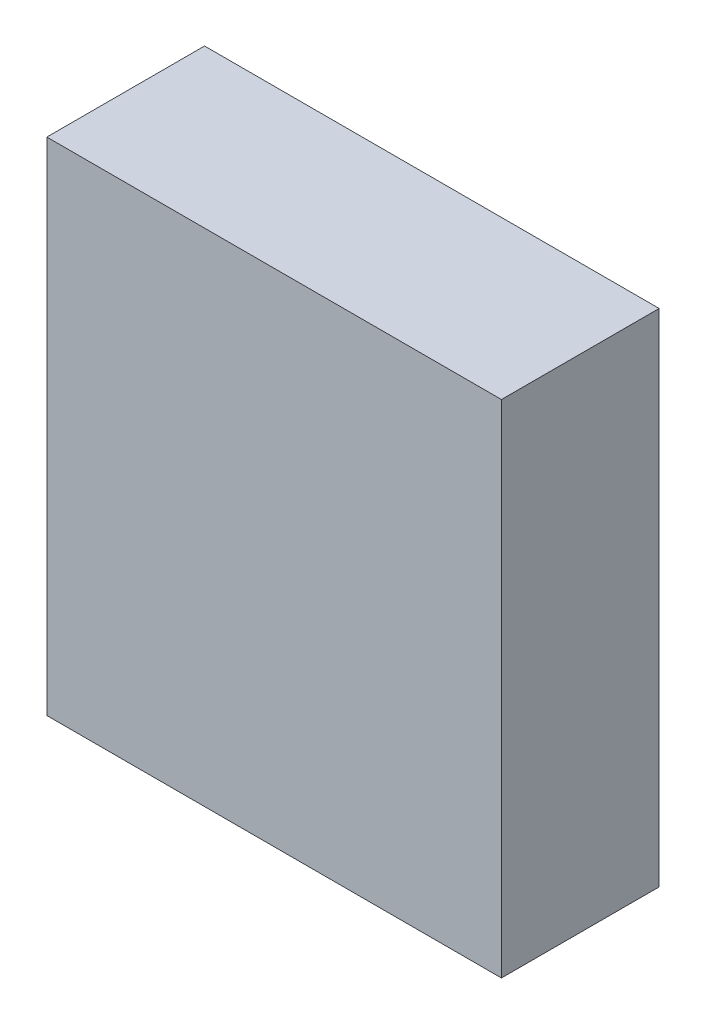
ISO-10303-21;
HEADER;
FILE_DESCRIPTION(('STEP AP214'),'2;1');
FILE_NAME('part.step','',(''),(''),'','','');
FILE_SCHEMA(('AUTOMOTIVE_DESIGN { 1 0 10303 214 1 1 1 1 }'));
ENDSEC;
DATA;
#1=APPLICATION_CONTEXT('core data for automotive mechanical design processes');
#2=APPLICATION_PROTOCOL_DEFINITION('international standard','automotive_design',2000,#1);
#3=PRODUCT_CONTEXT('',#1,'mechanical');
#4=PRODUCT('Part','Part','',(#3));
#5=PRODUCT_RELATED_PRODUCT_CATEGORY('part','',(#4));
#6=PRODUCT_DEFINITION_FORMATION('','',#4);
#7=PRODUCT_DEFINITION_CONTEXT('part definition',#1,'design');
#8=PRODUCT_DEFINITION('design','',#6,#7);
#9=PRODUCT_DEFINITION_SHAPE('','',#8);
#10=(LENGTH_UNIT() NAMED_UNIT(*) SI_UNIT(.MILLI.,.METRE.));
#11=(NAMED_UNIT(*) PLANE_ANGLE_UNIT() SI_UNIT($,.RADIAN.));
#12=(NAMED_UNIT(*) SI_UNIT($,.STERADIAN.) SOLID_ANGLE_UNIT());
#13=UNCERTAINTY_MEASURE_WITH_UNIT(LENGTH_MEASURE(1.E-05),#10,'distance_accuracy_value','');
#14=(GEOMETRIC_REPRESENTATION_CONTEXT(3) GLOBAL_UNCERTAINTY_ASSIGNED_CONTEXT((#13)) GLOBAL_UNIT_ASSIGNED_CONTEXT((#10,
#11,#12)) REPRESENTATION_CONTEXT('',''));
#15=CARTESIAN_POINT('',(0.,0.,0.));
#16=DIRECTION('',(0.,0.,1.));
#17=DIRECTION('',(1.,0.,0.));
#18=AXIS2_PLACEMENT_3D('',#15,#16,#17);
#19=CARTESIAN_POINT('',(-2.44999943891268,2.70000081888541,0.));
#20=DIRECTION('',(-1.,8.74227765734759E-08,0.));
#21=DIRECTION('',(-8.74227765734759E-08,-1.,0.));
#22=AXIS2_PLACEMENT_3D('',#19,#20,#21);
#23=PLANE('',#22);
#24=DIRECTION('',(-8.74227765512293E-08,-0.999999999999996,0.));
#25=VECTOR('',#24,1.);
#26=CARTESIAN_POINT('',(-2.44999943891268,2.70000081888541,0.));
#27=LINE('',#26,#25);
#28=CARTESIAN_POINT('',(-2.44999943891268,2.70000081888541,0.));
#29=VERTEX_POINT('',#28);
#30=CARTESIAN_POINT('',(-2.44999991099514,-2.69999307759896,0.));
#31=VERTEX_POINT('',#30);
#32=EDGE_CURVE('E11',#29,#31,#27,.T.);
#33=ORIENTED_EDGE('',*,*,#32,.T.);
#34=DIRECTION('',(0.,0.,1.));
#35=VECTOR('',#34,1.);
#36=CARTESIAN_POINT('',(-2.44999991099514,-2.69999307759896,0.));
#37=LINE('',#36,#35);
#38=CARTESIAN_POINT('',(-2.44999991099514,-2.69999307759896,1.6999990940094));
#39=VERTEX_POINT('',#38);
#40=EDGE_CURVE('E88',#31,#39,#37,.T.);
#41=ORIENTED_EDGE('',*,*,#40,.T.);
#42=DIRECTION('',(-8.74227765512293E-08,-0.999999999999996,0.));
#43=VECTOR('',#42,1.);
#44=CARTESIAN_POINT('',(-2.44999943891268,2.70000081888541,1.6999990940094));
#45=LINE('',#44,#43);
#46=CARTESIAN_POINT('',(-2.44999943891268,2.70000081888541,1.6999990940094));
#47=VERTEX_POINT('',#46);
#48=EDGE_CURVE('E83',#47,#39,#45,.T.);
#49=ORIENTED_EDGE('',*,*,#48,.F.);
#50=DIRECTION('',(0.,0.,1.));
#51=VECTOR('',#50,1.);
#52=CARTESIAN_POINT('',(-2.44999943891268,2.70000081888543,0.));
#53=LINE('',#52,#51);
#54=EDGE_CURVE('E72',#29,#47,#53,.T.);
#55=ORIENTED_EDGE('',*,*,#54,.F.);
#56=EDGE_LOOP('',(#33,#41,#49,#55));
#57=FACE_BOUND('',#56,.T.);
#58=ADVANCED_FACE('F17',(#57),#23,.T.);
#59=CARTESIAN_POINT('',(-2.44999991099514,-2.69999307759896,0.));
#60=DIRECTION('',(-8.74227765734758E-08,-1.,0.));
#61=DIRECTION('',(1.,-8.74227765734758E-08,0.));
#62=AXIS2_PLACEMENT_3D('',#59,#60,#61);
#63=PLANE('',#62);
#64=DIRECTION('',(0.999999999999996,-8.74227765529531E-08,0.));
#65=VECTOR('',#64,1.);
#66=CARTESIAN_POINT('',(-2.44999991099514,-2.69999307759896,0.));
#67=LINE('',#66,#65);
#68=CARTESIAN_POINT('',(2.4499978001865,-2.69999350597035,0.));
#69=VERTEX_POINT('',#68);
#70=EDGE_CURVE('E24',#31,#69,#67,.T.);
#71=ORIENTED_EDGE('',*,*,#70,.T.);
#72=DIRECTION('',(0.,0.,1.));
#73=VECTOR('',#72,1.);
#74=CARTESIAN_POINT('',(2.4499978001865,-2.69999350597037,0.));
#75=LINE('',#74,#73);
#76=CARTESIAN_POINT('',(2.4499978001865,-2.69999350597035,1.6999990940094));
#77=VERTEX_POINT('',#76);
#78=EDGE_CURVE('E85',#69,#77,#75,.T.);
#79=ORIENTED_EDGE('',*,*,#78,.T.);
#80=DIRECTION('',(0.999999999999996,-8.74227765529531E-08,0.));
#81=VECTOR('',#80,1.);
#82=CARTESIAN_POINT('',(-2.44999991099514,-2.69999307759896,1.6999990940094));
#83=LINE('',#82,#81);
#84=EDGE_CURVE('E66',#39,#77,#83,.T.);
#85=ORIENTED_EDGE('',*,*,#84,.F.);
#86=ORIENTED_EDGE('',*,*,#40,.F.);
#87=EDGE_LOOP('',(#71,#79,#85,#86));
#88=FACE_BOUND('',#87,.T.);
#89=ADVANCED_FACE('F89',(#88),#63,.T.);
#90=CARTESIAN_POINT('',(2.4499978001865,-2.69999350597035,0.));
#91=DIRECTION('',(1.,-8.74227765734759E-08,0.));
#92=DIRECTION('',(8.74227765734759E-08,1.,0.));
#93=AXIS2_PLACEMENT_3D('',#90,#91,#92);
#94=PLANE('',#93);
#95=DIRECTION('',(8.74227765512293E-08,0.999999999999996,0.));
#96=VECTOR('',#95,1.);
#97=CARTESIAN_POINT('',(2.4499978001865,-2.69999350597035,0.));
#98=LINE('',#97,#96);
#99=CARTESIAN_POINT('',(2.44999827226896,2.70000039051402,0.));
#100=VERTEX_POINT('',#99);
#101=EDGE_CURVE('E62',#69,#100,#98,.T.);
#102=ORIENTED_EDGE('',*,*,#101,.T.);
#103=DIRECTION('',(0.,0.,1.));
#104=VECTOR('',#103,1.);
#105=CARTESIAN_POINT('',(2.44999827226896,2.70000039051402,0.));
#106=LINE('',#105,#104);
#107=CARTESIAN_POINT('',(2.44999827226896,2.70000039051402,1.6999990940094));
#108=VERTEX_POINT('',#107);
#109=EDGE_CURVE('E55',#100,#108,#106,.T.);
#110=ORIENTED_EDGE('',*,*,#109,.T.);
#111=DIRECTION('',(8.74227765512293E-08,0.999999999999996,0.));
#112=VECTOR('',#111,1.);
#113=CARTESIAN_POINT('',(2.4499978001865,-2.69999350597035,1.6999990940094));
#114=LINE('',#113,#112);
#115=EDGE_CURVE('E59',#77,#108,#114,.T.);
#116=ORIENTED_EDGE('',*,*,#115,.F.);
#117=ORIENTED_EDGE('',*,*,#78,.F.);
#118=EDGE_LOOP('',(#102,#110,#116,#117));
#119=FACE_BOUND('',#118,.T.);
#120=ADVANCED_FACE('F57',(#119),#94,.T.);
#121=CARTESIAN_POINT('',(2.44999827226896,2.70000039051402,0.));
#122=DIRECTION('',(8.74227765734758E-08,1.,0.));
#123=DIRECTION('',(-1.,8.74227765734758E-08,0.));
#124=AXIS2_PLACEMENT_3D('',#121,#122,#123);
#125=PLANE('',#124);
#126=DIRECTION('',(-0.999999999999996,8.74227765529531E-08,0.));
#127=VECTOR('',#126,1.);
#128=CARTESIAN_POINT('',(2.44999827226896,2.70000039051402,0.));
#129=LINE('',#128,#127);
#130=EDGE_CURVE('E65',#100,#29,#129,.T.);
#131=ORIENTED_EDGE('',*,*,#130,.T.);
#132=ORIENTED_EDGE('',*,*,#54,.T.);
#133=DIRECTION('',(-0.999999999999996,8.74227765529531E-08,0.));
#134=VECTOR('',#133,1.);
#135=CARTESIAN_POINT('',(2.44999827226896,2.70000039051402,1.6999990940094));
#136=LINE('',#135,#134);
#137=EDGE_CURVE('E70',#108,#47,#136,.T.);
#138=ORIENTED_EDGE('',*,*,#137,.F.);
#139=ORIENTED_EDGE('',*,*,#109,.F.);
#140=EDGE_LOOP('',(#131,#132,#138,#139));
#141=FACE_BOUND('',#140,.T.);
#142=ADVANCED_FACE('F71',(#141),#125,.T.);
#143=CARTESIAN_POINT('',(41.8250045776367,74.8249969482422,1.6999990940094));
#144=DIRECTION('',(0.,0.,1.));
#145=DIRECTION('',(-1.,8.74227765734759E-08,0.));
#146=AXIS2_PLACEMENT_3D('',#143,#144,#145);
#147=PLANE('',#146);
#148=ORIENTED_EDGE('',*,*,#48,.T.);
#149=ORIENTED_EDGE('',*,*,#84,.T.);
#150=ORIENTED_EDGE('',*,*,#115,.T.);
#151=ORIENTED_EDGE('',*,*,#137,.T.);
#152=EDGE_LOOP('',(#148,#149,#150,#151));
#153=FACE_BOUND('',#152,.T.);
#154=ADVANCED_FACE('F76',(#153),#147,.T.);
#155=CARTESIAN_POINT('',(41.8250045776367,74.8249969482422,0.));
#156=DIRECTION('',(0.,0.,1.));
#157=DIRECTION('',(-1.,8.74227765734759E-08,0.));
#158=AXIS2_PLACEMENT_3D('',#155,#156,#157);
#159=PLANE('',#158);
#160=ORIENTED_EDGE('',*,*,#130,.F.);
#161=ORIENTED_EDGE('',*,*,#101,.F.);
#162=ORIENTED_EDGE('',*,*,#70,.F.);
#163=ORIENTED_EDGE('',*,*,#32,.F.);
#164=EDGE_LOOP('',(#160,#161,#162,#163));
#165=FACE_BOUND('',#164,.T.);
#166=ADVANCED_FACE('F91',(#165),#159,.F.);
#167=CLOSED_SHELL('',(#58,#89,#120,#142,#154,#166));
#168=MANIFOLD_SOLID_BREP('B1',#167);
#169=ADVANCED_BREP_SHAPE_REPRESENTATION('',(#18,#168),#14);
#170=SHAPE_DEFINITION_REPRESENTATION(#9,#169);
ENDSEC;
END-ISO-10303-21;
